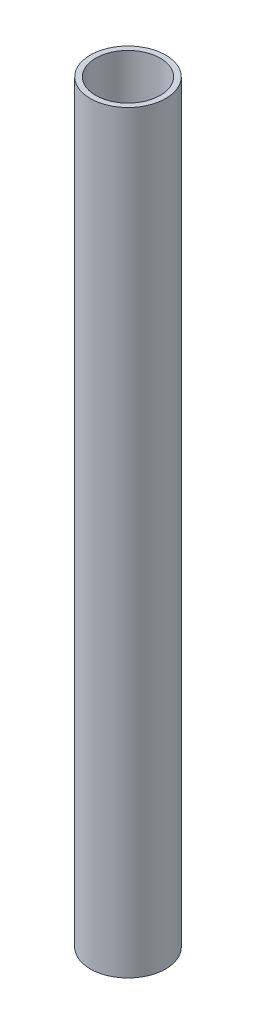
ISO-10303-21;
HEADER;
FILE_DESCRIPTION(('STEP AP214'),'2;1');
FILE_NAME('part.step','',(''),(''),'','','');
FILE_SCHEMA(('AUTOMOTIVE_DESIGN { 1 0 10303 214 1 1 1 1 }'));
ENDSEC;
DATA;
#1=APPLICATION_CONTEXT('core data for automotive mechanical design processes');
#2=APPLICATION_PROTOCOL_DEFINITION('international standard','automotive_design',2000,#1);
#3=PRODUCT_CONTEXT('',#1,'mechanical');
#4=PRODUCT('Part','Part','',(#3));
#5=PRODUCT_RELATED_PRODUCT_CATEGORY('part','',(#4));
#6=PRODUCT_DEFINITION_FORMATION('','',#4);
#7=PRODUCT_DEFINITION_CONTEXT('part definition',#1,'design');
#8=PRODUCT_DEFINITION('design','',#6,#7);
#9=PRODUCT_DEFINITION_SHAPE('','',#8);
#10=(LENGTH_UNIT() NAMED_UNIT(*) SI_UNIT(.MILLI.,.METRE.));
#11=(NAMED_UNIT(*) PLANE_ANGLE_UNIT() SI_UNIT($,.RADIAN.));
#12=(NAMED_UNIT(*) SI_UNIT($,.STERADIAN.) SOLID_ANGLE_UNIT());
#13=UNCERTAINTY_MEASURE_WITH_UNIT(LENGTH_MEASURE(1.E-05),#10,'distance_accuracy_value','');
#14=(GEOMETRIC_REPRESENTATION_CONTEXT(3) GLOBAL_UNCERTAINTY_ASSIGNED_CONTEXT((#13)) GLOBAL_UNIT_ASSIGNED_CONTEXT((#10,
#11,#12)) REPRESENTATION_CONTEXT('',''));
#15=CARTESIAN_POINT('',(0.,0.,0.));
#16=DIRECTION('',(0.,0.,1.));
#17=DIRECTION('',(1.,0.,0.));
#18=AXIS2_PLACEMENT_3D('',#15,#16,#17);
#19=CARTESIAN_POINT('',(0.,140.,0.));
#20=DIRECTION('',(0.,1.,0.));
#21=DIRECTION('',(0.,0.,1.));
#22=AXIS2_PLACEMENT_3D('',#19,#20,#21);
#23=PLANE('',#22);
#24=CARTESIAN_POINT('',(0.,140.,0.));
#25=DIRECTION('',(0.,1.,0.));
#26=DIRECTION('',(0.,0.,1.));
#27=AXIS2_PLACEMENT_3D('',#24,#25,#26);
#28=CIRCLE('',#27,7.);
#29=CARTESIAN_POINT('',(0.,140.,7.));
#30=VERTEX_POINT('',#29);
#31=EDGE_CURVE('E10',#30,#30,#28,.T.);
#32=ORIENTED_EDGE('',*,*,#31,.T.);
#33=EDGE_LOOP('',(#32));
#34=FACE_BOUND('',#33,.T.);
#35=CARTESIAN_POINT('',(0.,140.,0.));
#36=DIRECTION('',(0.,1.,0.));
#37=DIRECTION('',(0.,0.,1.));
#38=AXIS2_PLACEMENT_3D('',#35,#36,#37);
#39=CIRCLE('',#38,6.);
#40=CARTESIAN_POINT('',(0.,140.,6.));
#41=VERTEX_POINT('',#40);
#42=EDGE_CURVE('E46',#41,#41,#39,.T.);
#43=ORIENTED_EDGE('',*,*,#42,.F.);
#44=EDGE_LOOP('',(#43));
#45=FACE_BOUND('',#44,.T.);
#46=ADVANCED_FACE('F35',(#34,#45),#23,.T.);
#47=CARTESIAN_POINT('',(0.,0.,0.));
#48=DIRECTION('',(0.,1.,0.));
#49=DIRECTION('',(0.,0.,1.));
#50=AXIS2_PLACEMENT_3D('',#47,#48,#49);
#51=PLANE('',#50);
#52=CARTESIAN_POINT('',(0.,0.,0.));
#53=DIRECTION('',(0.,1.,0.));
#54=DIRECTION('',(0.,0.,1.));
#55=AXIS2_PLACEMENT_3D('',#52,#53,#54);
#56=CIRCLE('',#55,7.);
#57=CARTESIAN_POINT('',(0.,0.,7.));
#58=VERTEX_POINT('',#57);
#59=EDGE_CURVE('E39',#58,#58,#56,.T.);
#60=ORIENTED_EDGE('',*,*,#59,.F.);
#61=EDGE_LOOP('',(#60));
#62=FACE_BOUND('',#61,.T.);
#63=CARTESIAN_POINT('',(0.,0.,0.));
#64=DIRECTION('',(0.,1.,0.));
#65=DIRECTION('',(0.,0.,1.));
#66=AXIS2_PLACEMENT_3D('',#63,#64,#65);
#67=CIRCLE('',#66,6.);
#68=CARTESIAN_POINT('',(0.,0.,6.));
#69=VERTEX_POINT('',#68);
#70=EDGE_CURVE('E48',#69,#69,#67,.T.);
#71=ORIENTED_EDGE('',*,*,#70,.T.);
#72=EDGE_LOOP('',(#71));
#73=FACE_BOUND('',#72,.T.);
#74=ADVANCED_FACE('F58',(#62,#73),#51,.F.);
#75=CARTESIAN_POINT('',(0.,140.,0.));
#76=DIRECTION('',(0.,-1.,0.));
#77=DIRECTION('',(0.,0.,-1.));
#78=AXIS2_PLACEMENT_3D('',#75,#76,#77);
#79=CYLINDRICAL_SURFACE('',#78,7.);
#80=ORIENTED_EDGE('',*,*,#31,.F.);
#81=EDGE_LOOP('',(#80));
#82=FACE_BOUND('',#81,.T.);
#83=ORIENTED_EDGE('',*,*,#59,.T.);
#84=EDGE_LOOP('',(#83));
#85=FACE_BOUND('',#84,.T.);
#86=ADVANCED_FACE('F37',(#82,#85),#79,.T.);
#87=CARTESIAN_POINT('',(0.,140.,0.));
#88=DIRECTION('',(0.,-1.,0.));
#89=DIRECTION('',(0.,0.,-1.));
#90=AXIS2_PLACEMENT_3D('',#87,#88,#89);
#91=CYLINDRICAL_SURFACE('',#90,6.);
#92=ORIENTED_EDGE('',*,*,#42,.T.);
#93=EDGE_LOOP('',(#92));
#94=FACE_BOUND('',#93,.T.);
#95=ORIENTED_EDGE('',*,*,#70,.F.);
#96=EDGE_LOOP('',(#95));
#97=FACE_BOUND('',#96,.T.);
#98=ADVANCED_FACE('F54',(#94,#97),#91,.F.);
#99=CLOSED_SHELL('',(#46,#74,#86,#98));
#100=MANIFOLD_SOLID_BREP('B2',#99);
#101=ADVANCED_BREP_SHAPE_REPRESENTATION('',(#18,#100),#14);
#102=SHAPE_DEFINITION_REPRESENTATION(#9,#101);
ENDSEC;
END-ISO-10303-21;
